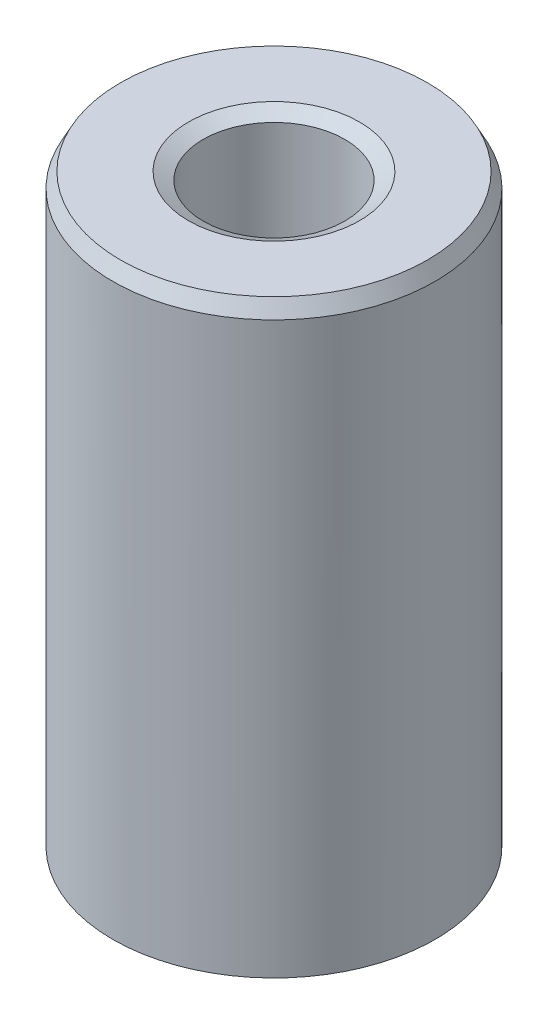
ISO-10303-21;
HEADER;
FILE_DESCRIPTION(('STEP AP214'),'2;1');
FILE_NAME('part.step','',(''),(''),'','','');
FILE_SCHEMA(('AUTOMOTIVE_DESIGN { 1 0 10303 214 1 1 1 1 }'));
ENDSEC;
DATA;
#1=APPLICATION_CONTEXT('core data for automotive mechanical design processes');
#2=APPLICATION_PROTOCOL_DEFINITION('international standard','automotive_design',2000,#1);
#3=PRODUCT_CONTEXT('',#1,'mechanical');
#4=PRODUCT('Part','Part','',(#3));
#5=PRODUCT_RELATED_PRODUCT_CATEGORY('part','',(#4));
#6=PRODUCT_DEFINITION_FORMATION('','',#4);
#7=PRODUCT_DEFINITION_CONTEXT('part definition',#1,'design');
#8=PRODUCT_DEFINITION('design','',#6,#7);
#9=PRODUCT_DEFINITION_SHAPE('','',#8);
#10=(LENGTH_UNIT() NAMED_UNIT(*) SI_UNIT(.MILLI.,.METRE.));
#11=(NAMED_UNIT(*) PLANE_ANGLE_UNIT() SI_UNIT($,.RADIAN.));
#12=(NAMED_UNIT(*) SI_UNIT($,.STERADIAN.) SOLID_ANGLE_UNIT());
#13=UNCERTAINTY_MEASURE_WITH_UNIT(LENGTH_MEASURE(1.E-05),#10,'distance_accuracy_value','');
#14=(GEOMETRIC_REPRESENTATION_CONTEXT(3) GLOBAL_UNCERTAINTY_ASSIGNED_CONTEXT((#13)) GLOBAL_UNIT_ASSIGNED_CONTEXT((#10,
#11,#12)) REPRESENTATION_CONTEXT('',''));
#15=CARTESIAN_POINT('',(0.,0.,0.));
#16=DIRECTION('',(0.,0.,1.));
#17=DIRECTION('',(1.,0.,0.));
#18=AXIS2_PLACEMENT_3D('',#15,#16,#17);
#19=CARTESIAN_POINT('',(0.,55.1128851822526,0.));
#20=DIRECTION('',(0.,-1.,0.));
#21=DIRECTION('',(0.,0.,-1.));
#22=AXIS2_PLACEMENT_3D('',#19,#20,#21);
#23=CYLINDRICAL_SURFACE('',#22,15.);
#24=CARTESIAN_POINT('',(0.,0.715288435799932,0.));
#25=DIRECTION('',(0.,1.,0.));
#26=DIRECTION('',(0.,0.,1.));
#27=AXIS2_PLACEMENT_3D('',#24,#25,#26);
#28=CIRCLE('',#27,15.);
#29=CARTESIAN_POINT('',(0.,0.715288435799925,-15.));
#30=VERTEX_POINT('',#29);
#31=EDGE_CURVE('E10',#30,#30,#28,.T.);
#32=CARTESIAN_POINT('',(0.,53.7436358366034,0.));
#33=DIRECTION('',(0.,1.,0.));
#34=DIRECTION('',(0.,0.,1.));
#35=AXIS2_PLACEMENT_3D('',#32,#33,#34);
#36=CIRCLE('',#35,15.);
#37=CARTESIAN_POINT('',(0.,53.7436358366034,-15.));
#38=VERTEX_POINT('',#37);
#39=EDGE_CURVE('E50',#38,#38,#36,.F.);
#40=CARTESIAN_POINT('',(0.,0.715288435799925,-15.));
#41=CARTESIAN_POINT('',(0.,1.2676670545583,-15.));
#42=CARTESIAN_POINT('',(0.,1.82004567331667,-15.));
#43=CARTESIAN_POINT('',(0.,2.92480291083341,-15.));
#44=CARTESIAN_POINT('',(0.,3.47718152959178,-15.));
#45=CARTESIAN_POINT('',(0.,4.58193876710852,-15.));
#46=CARTESIAN_POINT('',(0.,5.13431738586689,-15.));
#47=CARTESIAN_POINT('',(0.,6.23907462338362,-15.));
#48=CARTESIAN_POINT('',(0.,6.79145324214199,-15.));
#49=CARTESIAN_POINT('',(0.,7.89621047965873,-15.));
#50=CARTESIAN_POINT('',(0.,8.4485890984171,-15.));
#51=CARTESIAN_POINT('',(0.,9.55334633593384,-15.));
#52=CARTESIAN_POINT('',(0.,10.1057249546922,-15.));
#53=CARTESIAN_POINT('',(0.,11.210482192209,-15.));
#54=CARTESIAN_POINT('',(0.,11.7628608109673,-15.));
#55=CARTESIAN_POINT('',(0.,12.8676180484841,-15.));
#56=CARTESIAN_POINT('',(0.,13.4199966672424,-15.));
#57=CARTESIAN_POINT('',(0.,14.5247539047592,-15.));
#58=CARTESIAN_POINT('',(0.,15.0771325235175,-15.));
#59=CARTESIAN_POINT('',(0.,16.1818897610343,-15.));
#60=CARTESIAN_POINT('',(0.,16.7342683797926,-15.));
#61=CARTESIAN_POINT('',(0.,17.8390256173094,-15.));
#62=CARTESIAN_POINT('',(0.,18.3914042360678,-15.));
#63=CARTESIAN_POINT('',(0.,19.4961614735845,-15.));
#64=CARTESIAN_POINT('',(0.,20.0485400923429,-15.));
#65=CARTESIAN_POINT('',(0.,21.1532973298596,-15.));
#66=CARTESIAN_POINT('',(0.,21.705675948618,-15.));
#67=CARTESIAN_POINT('',(0.,22.8104331861347,-15.));
#68=CARTESIAN_POINT('',(0.,23.3628118048931,-15.));
#69=CARTESIAN_POINT('',(0.,24.4675690424098,-15.));
#70=CARTESIAN_POINT('',(0.,25.0199476611682,-15.));
#71=CARTESIAN_POINT('',(0.,26.1247048986849,-15.));
#72=CARTESIAN_POINT('',(0.,26.6770835174433,-15.));
#73=CARTESIAN_POINT('',(0.,27.78184075496,-15.));
#74=CARTESIAN_POINT('',(0.,28.3342193737184,-15.));
#75=CARTESIAN_POINT('',(0.,29.4389766112352,-15.));
#76=CARTESIAN_POINT('',(0.,29.9913552299935,-15.));
#77=CARTESIAN_POINT('',(0.,31.0961124675103,-15.));
#78=CARTESIAN_POINT('',(0.,31.6484910862686,-15.));
#79=CARTESIAN_POINT('',(0.,32.7532483237854,-15.));
#80=CARTESIAN_POINT('',(0.,33.3056269425437,-15.));
#81=CARTESIAN_POINT('',(0.,34.4103841800605,-15.));
#82=CARTESIAN_POINT('',(0.,34.9627627988189,-15.));
#83=CARTESIAN_POINT('',(0.,36.0675200363356,-15.));
#84=CARTESIAN_POINT('',(0.,36.619898655094,-15.));
#85=CARTESIAN_POINT('',(0.,37.7246558926107,-15.));
#86=CARTESIAN_POINT('',(0.,38.2770345113691,-15.));
#87=CARTESIAN_POINT('',(0.,39.3817917488858,-15.));
#88=CARTESIAN_POINT('',(0.,39.9341703676442,-15.));
#89=CARTESIAN_POINT('',(0.,41.0389276051609,-15.));
#90=CARTESIAN_POINT('',(0.,41.5913062239193,-15.));
#91=CARTESIAN_POINT('',(0.,42.696063461436,-15.));
#92=CARTESIAN_POINT('',(0.,43.2484420801944,-15.));
#93=CARTESIAN_POINT('',(0.,44.3531993177111,-15.));
#94=CARTESIAN_POINT('',(0.,44.9055779364695,-15.));
#95=CARTESIAN_POINT('',(0.,46.0103351739862,-15.));
#96=CARTESIAN_POINT('',(0.,46.5627137927446,-15.));
#97=CARTESIAN_POINT('',(0.,47.6674710302614,-15.));
#98=CARTESIAN_POINT('',(0.,48.2198496490197,-15.));
#99=CARTESIAN_POINT('',(0.,49.3246068865365,-15.));
#100=CARTESIAN_POINT('',(0.,49.8769855052948,-15.));
#101=CARTESIAN_POINT('',(0.,50.9817427428116,-15.));
#102=CARTESIAN_POINT('',(0.,51.5341213615699,-15.));
#103=CARTESIAN_POINT('',(0.,52.6388785990867,-15.));
#104=CARTESIAN_POINT('',(0.,53.191257217845,-15.));
#105=CARTESIAN_POINT('',(0.,53.7436358366034,-15.));
#106=B_SPLINE_CURVE_WITH_KNOTS('',3,(#40,#41,#42,#43,#44,#45,#46,#47,#48,#49,#50,#51,#52,#53,
#54,#55,#56,#57,#58,#59,#60,#61,#62,#63,#64,#65,#66,#67,#68,#69,#70,#71,#72,#73,#74,#75,#76,#77,
#78,#79,#80,#81,#82,#83,#84,#85,#86,#87,#88,#89,#90,#91,#92,#93,#94,#95,#96,#97,#98,#99,#100,
#101,#102,#103,#104,#105),.UNSPECIFIED.,.F.,.F.,(4,2,2,2,2,2,2,2,2,2,2,2,2,2,2,2,2,2,2,2,2,2,2,
2,2,2,2,2,2,2,2,2,4),(0.,1.65713585627511,3.31427171255022,4.97140756882533,6.62854342510043,
8.28567928137555,9.94281513765065,11.5999509939258,13.2570868502009,14.914222706476,
16.5713585627511,18.2284944190262,19.8856302753013,21.5427661315764,23.1999019878515,
24.8570378441266,26.5141737004017,28.1713095566769,29.828445412952,31.4855812692271,
33.1427171255022,34.7998529817773,36.4569888380524,38.1141246943275,39.7712605506026,
41.4283964068777,43.0855322631528,44.7426681194279,46.3998039757031,48.0569398319782,
49.7140756882533,51.3712115445284,53.0283474008035),.UNSPECIFIED.);
#107=EDGE_CURVE('BSEAM39',#30,#38,#106,.T.);
#108=ORIENTED_EDGE('',*,*,#31,.T.);
#109=ORIENTED_EDGE('',*,*,#39,.T.);
#110=ORIENTED_EDGE('',*,*,#107,.T.);
#111=ORIENTED_EDGE('',*,*,#107,.F.);
#112=EDGE_LOOP('',(#108,#110,#109,#111));
#113=FACE_BOUND('',#112,.T.);
#114=ADVANCED_FACE('F39',(#113),#23,.T.);
#115=CARTESIAN_POINT('',(0.,55.1128851822526,0.));
#116=DIRECTION('',(0.,1.,0.));
#117=DIRECTION('',(0.,0.,1.));
#118=AXIS2_PLACEMENT_3D('',#115,#116,#117);
#119=PLANE('',#118);
#120=CARTESIAN_POINT('',(0.,55.1128851822526,0.));
#121=DIRECTION('',(0.,1.,0.));
#122=DIRECTION('',(0.,0.,1.));
#123=AXIS2_PLACEMENT_3D('',#120,#121,#122);
#124=CIRCLE('',#123,7.95987748376961);
#125=CARTESIAN_POINT('',(0.,55.1128851822526,7.95987748376961));
#126=VERTEX_POINT('',#125);
#127=EDGE_CURVE('E58',#126,#126,#124,.F.);
#128=ORIENTED_EDGE('',*,*,#127,.T.);
#129=EDGE_LOOP('',(#128));
#130=FACE_BOUND('',#129,.T.);
#131=CARTESIAN_POINT('',(0.,55.1128851822526,0.));
#132=DIRECTION('',(0.,1.,0.));
#133=DIRECTION('',(0.,0.,1.));
#134=AXIS2_PLACEMENT_3D('',#131,#132,#133);
#135=CIRCLE('',#134,14.2847115642001);
#136=CARTESIAN_POINT('',(0.,55.1128851822526,14.2847115642001));
#137=VERTEX_POINT('',#136);
#138=EDGE_CURVE('E61',#137,#137,#135,.T.);
#139=ORIENTED_EDGE('',*,*,#138,.T.);
#140=EDGE_LOOP('',(#139));
#141=FACE_BOUND('',#140,.T.);
#142=ADVANCED_FACE('F88',(#130,#141),#119,.T.);
#143=CARTESIAN_POINT('',(0.,0.,0.));
#144=DIRECTION('',(0.,1.,0.));
#145=DIRECTION('',(0.,0.,1.));
#146=AXIS2_PLACEMENT_3D('',#143,#144,#145);
#147=PLANE('',#146);
#148=CARTESIAN_POINT('',(0.,0.,0.));
#149=DIRECTION('',(0.,1.,0.));
#150=DIRECTION('',(0.,0.,1.));
#151=AXIS2_PLACEMENT_3D('',#148,#149,#150);
#152=CIRCLE('',#151,7.30591657392028);
#153=CARTESIAN_POINT('',(0.,0.,7.30591657392028));
#154=VERTEX_POINT('',#153);
#155=EDGE_CURVE('E51',#154,#154,#152,.T.);
#156=ORIENTED_EDGE('',*,*,#155,.T.);
#157=EDGE_LOOP('',(#156));
#158=FACE_BOUND('',#157,.T.);
#159=CARTESIAN_POINT('',(0.,0.,0.));
#160=DIRECTION('',(0.,1.,0.));
#161=DIRECTION('',(0.,0.,1.));
#162=AXIS2_PLACEMENT_3D('',#159,#160,#161);
#163=CIRCLE('',#162,13.6307506543508);
#164=CARTESIAN_POINT('',(0.,0.,13.6307506543508));
#165=VERTEX_POINT('',#164);
#166=EDGE_CURVE('E54',#165,#165,#163,.F.);
#167=ORIENTED_EDGE('',*,*,#166,.T.);
#168=EDGE_LOOP('',(#167));
#169=FACE_BOUND('',#168,.T.);
#170=ADVANCED_FACE('F83',(#158,#169),#147,.F.);
#171=CARTESIAN_POINT('',(0.,55.1128851822526,0.));
#172=DIRECTION('',(0.,-1.,0.));
#173=DIRECTION('',(0.,0.,-1.));
#174=AXIS2_PLACEMENT_3D('',#171,#172,#173);
#175=CYLINDRICAL_SURFACE('',#174,6.59062813812038);
#176=CARTESIAN_POINT('',(0.,54.3975967464526,0.));
#177=DIRECTION('',(0.,1.,0.));
#178=DIRECTION('',(0.,0.,1.));
#179=AXIS2_PLACEMENT_3D('',#176,#177,#178);
#180=CIRCLE('',#179,6.59062813812038);
#181=CARTESIAN_POINT('',(0.,54.3975967464526,-6.59062813812038));
#182=VERTEX_POINT('',#181);
#183=EDGE_CURVE('E67',#182,#182,#180,.T.);
#184=CARTESIAN_POINT('',(0.,1.36924934564917,0.));
#185=DIRECTION('',(0.,1.,0.));
#186=DIRECTION('',(0.,0.,1.));
#187=AXIS2_PLACEMENT_3D('',#184,#185,#186);
#188=CIRCLE('',#187,6.59062813812038);
#189=CARTESIAN_POINT('',(0.,1.36924934564917,-6.59062813812038));
#190=VERTEX_POINT('',#189);
#191=EDGE_CURVE('E69',#190,#190,#188,.F.);
#192=CARTESIAN_POINT('',(0.,54.3975967464526,-6.59062813812038));
#193=CARTESIAN_POINT('',(0.,53.8452181276943,-6.59062813812038));
#194=CARTESIAN_POINT('',(0.,53.2928395089359,-6.59062813812038));
#195=CARTESIAN_POINT('',(0.,52.1880822714191,-6.59062813812038));
#196=CARTESIAN_POINT('',(0.,51.6357036526608,-6.59062813812038));
#197=CARTESIAN_POINT('',(0.,50.530946415144,-6.59062813812038));
#198=CARTESIAN_POINT('',(0.,49.9785677963857,-6.59062813812038));
#199=CARTESIAN_POINT('',(0.,48.8738105588689,-6.59062813812038));
#200=CARTESIAN_POINT('',(0.,48.3214319401106,-6.59062813812038));
#201=CARTESIAN_POINT('',(0.,47.2166747025938,-6.59062813812038));
#202=CARTESIAN_POINT('',(0.,46.6642960838355,-6.59062813812038));
#203=CARTESIAN_POINT('',(0.,45.5595388463187,-6.59062813812038));
#204=CARTESIAN_POINT('',(0.,45.0071602275603,-6.59062813812038));
#205=CARTESIAN_POINT('',(0.,43.9024029900436,-6.59062813812038));
#206=CARTESIAN_POINT('',(0.,43.3500243712852,-6.59062813812038));
#207=CARTESIAN_POINT('',(0.,42.2452671337685,-6.59062813812038));
#208=CARTESIAN_POINT('',(0.,41.6928885150101,-6.59062813812038));
#209=CARTESIAN_POINT('',(0.,40.5881312774934,-6.59062813812038));
#210=CARTESIAN_POINT('',(0.,40.035752658735,-6.59062813812038));
#211=CARTESIAN_POINT('',(0.,38.9309954212183,-6.59062813812038));
#212=CARTESIAN_POINT('',(0.,38.3786168024599,-6.59062813812038));
#213=CARTESIAN_POINT('',(0.,37.2738595649432,-6.59062813812038));
#214=CARTESIAN_POINT('',(0.,36.7214809461848,-6.59062813812038));
#215=CARTESIAN_POINT('',(0.,35.6167237086681,-6.59062813812038));
#216=CARTESIAN_POINT('',(0.,35.0643450899097,-6.59062813812038));
#217=CARTESIAN_POINT('',(0.,33.959587852393,-6.59062813812038));
#218=CARTESIAN_POINT('',(0.,33.4072092336346,-6.59062813812038));
#219=CARTESIAN_POINT('',(0.,32.3024519961179,-6.59062813812038));
#220=CARTESIAN_POINT('',(0.,31.7500733773595,-6.59062813812038));
#221=CARTESIAN_POINT('',(0.,30.6453161398427,-6.59062813812038));
#222=CARTESIAN_POINT('',(0.,30.0929375210844,-6.59062813812038));
#223=CARTESIAN_POINT('',(0.,28.9881802835676,-6.59062813812038));
#224=CARTESIAN_POINT('',(0.,28.4358016648093,-6.59062813812038));
#225=CARTESIAN_POINT('',(0.,27.3310444272925,-6.59062813812038));
#226=CARTESIAN_POINT('',(0.,26.7786658085342,-6.59062813812038));
#227=CARTESIAN_POINT('',(0.,25.6739085710174,-6.59062813812038));
#228=CARTESIAN_POINT('',(0.,25.1215299522591,-6.59062813812038));
#229=CARTESIAN_POINT('',(0.,24.0167727147423,-6.59062813812038));
#230=CARTESIAN_POINT('',(0.,23.4643940959839,-6.59062813812038));
#231=CARTESIAN_POINT('',(0.,22.3596368584672,-6.59062813812038));
#232=CARTESIAN_POINT('',(0.,21.8072582397088,-6.59062813812038));
#233=CARTESIAN_POINT('',(0.,20.7025010021921,-6.59062813812038));
#234=CARTESIAN_POINT('',(0.,20.1501223834337,-6.59062813812038));
#235=CARTESIAN_POINT('',(0.,19.045365145917,-6.59062813812038));
#236=CARTESIAN_POINT('',(0.,18.4929865271586,-6.59062813812038));
#237=CARTESIAN_POINT('',(0.,17.3882292896419,-6.59062813812038));
#238=CARTESIAN_POINT('',(0.,16.8358506708835,-6.59062813812038));
#239=CARTESIAN_POINT('',(0.,15.7310934333668,-6.59062813812038));
#240=CARTESIAN_POINT('',(0.,15.1787148146084,-6.59062813812038));
#241=CARTESIAN_POINT('',(0.,14.0739575770917,-6.59062813812038));
#242=CARTESIAN_POINT('',(0.,13.5215789583333,-6.59062813812038));
#243=CARTESIAN_POINT('',(0.,12.4168217208166,-6.59062813812038));
#244=CARTESIAN_POINT('',(0.,11.8644431020582,-6.59062813812038));
#245=CARTESIAN_POINT('',(0.,10.7596858645415,-6.59062813812038));
#246=CARTESIAN_POINT('',(0.,10.2073072457831,-6.59062813812038));
#247=CARTESIAN_POINT('',(0.,9.10255000826634,-6.59062813812038));
#248=CARTESIAN_POINT('',(0.,8.55017138950797,-6.59062813812038));
#249=CARTESIAN_POINT('',(0.,7.44541415199124,-6.59062813812038));
#250=CARTESIAN_POINT('',(0.,6.89303553323287,-6.59062813812038));
#251=CARTESIAN_POINT('',(0.,5.78827829571613,-6.59062813812038));
#252=CARTESIAN_POINT('',(0.,5.23589967695776,-6.59062813812038));
#253=CARTESIAN_POINT('',(0.,4.13114243944102,-6.59062813812038));
#254=CARTESIAN_POINT('',(0.,3.57876382068265,-6.59062813812038));
#255=CARTESIAN_POINT('',(0.,2.47400658316591,-6.59062813812038));
#256=CARTESIAN_POINT('',(0.,1.92162796440754,-6.59062813812038));
#257=CARTESIAN_POINT('',(0.,1.36924934564917,-6.59062813812038));
#258=B_SPLINE_CURVE_WITH_KNOTS('',3,(#192,#193,#194,#195,#196,#197,#198,#199,#200,#201,#202,
#203,#204,#205,#206,#207,#208,#209,#210,#211,#212,#213,#214,#215,#216,#217,#218,#219,#220,#221,
#222,#223,#224,#225,#226,#227,#228,#229,#230,#231,#232,#233,#234,#235,#236,#237,#238,#239,#240,
#241,#242,#243,#244,#245,#246,#247,#248,#249,#250,#251,#252,#253,#254,#255,#256,#257),
.UNSPECIFIED.,.F.,.F.,(4,2,2,2,2,2,2,2,2,2,2,2,2,2,2,2,2,2,2,2,2,2,2,2,2,2,2,2,2,2,2,2,4),(0.,
1.6571358562751,3.31427171255021,4.97140756882532,6.62854342510043,8.28567928137553,
9.94281513765064,11.5999509939258,13.2570868502009,14.914222706476,16.5713585627511,
18.2284944190262,19.8856302753013,21.5427661315764,23.1999019878515,24.8570378441266,
26.5141737004017,28.1713095566768,29.8284454129519,31.485581269227,33.1427171255022,
34.7998529817773,36.4569888380524,38.1141246943275,39.7712605506026,41.4283964068777,
43.0855322631528,44.7426681194279,46.399803975703,48.0569398319781,49.7140756882532,
51.3712115445283,53.0283474008034),.UNSPECIFIED.);
#259=EDGE_CURVE('BSEAM71',#182,#190,#258,.T.);
#260=ORIENTED_EDGE('',*,*,#183,.T.);
#261=ORIENTED_EDGE('',*,*,#191,.T.);
#262=ORIENTED_EDGE('',*,*,#259,.T.);
#263=ORIENTED_EDGE('',*,*,#259,.F.);
#264=EDGE_LOOP('',(#260,#262,#261,#263));
#265=FACE_BOUND('',#264,.T.);
#266=ADVANCED_FACE('F71',(#265),#175,.F.);
#267=CARTESIAN_POINT('',(0.,54.3975967464526,0.));
#268=DIRECTION('',(0.,1.,0.));
#269=DIRECTION('',(0.,0.,1.));
#270=AXIS2_PLACEMENT_3D('',#267,#268,#269);
#271=CONICAL_SURFACE('',#270,6.59062813812038,1.08939398090596);
#272=ORIENTED_EDGE('',*,*,#127,.F.);
#273=EDGE_LOOP('',(#272));
#274=FACE_BOUND('',#273,.T.);
#275=ORIENTED_EDGE('',*,*,#183,.F.);
#276=EDGE_LOOP('',(#275));
#277=FACE_BOUND('',#276,.T.);
#278=ADVANCED_FACE('F77',(#274,#277),#271,.F.);
#279=CARTESIAN_POINT('',(0.,0.,0.));
#280=DIRECTION('',(0.,-1.,0.));
#281=DIRECTION('',(0.,0.,-1.));
#282=AXIS2_PLACEMENT_3D('',#279,#280,#281);
#283=CONICAL_SURFACE('',#282,7.30591657392028,0.481402345888939);
#284=ORIENTED_EDGE('',*,*,#191,.F.);
#285=EDGE_LOOP('',(#284));
#286=FACE_BOUND('',#285,.T.);
#287=ORIENTED_EDGE('',*,*,#155,.F.);
#288=EDGE_LOOP('',(#287));
#289=FACE_BOUND('',#288,.T.);
#290=ADVANCED_FACE('F73',(#286,#289),#283,.F.);
#291=CARTESIAN_POINT('',(0.,0.715288435799932,0.));
#292=DIRECTION('',(0.,1.,0.));
#293=DIRECTION('',(0.,0.,1.));
#294=AXIS2_PLACEMENT_3D('',#291,#292,#293);
#295=CONICAL_SURFACE('',#294,15.,1.08939398090595);
#296=ORIENTED_EDGE('',*,*,#166,.F.);
#297=EDGE_LOOP('',(#296));
#298=FACE_BOUND('',#297,.T.);
#299=ORIENTED_EDGE('',*,*,#31,.F.);
#300=EDGE_LOOP('',(#299));
#301=FACE_BOUND('',#300,.T.);
#302=ADVANCED_FACE('F76',(#298,#301),#295,.T.);
#303=CARTESIAN_POINT('',(0.,55.1128851822526,0.));
#304=DIRECTION('',(0.,-1.,0.));
#305=DIRECTION('',(0.,0.,-1.));
#306=AXIS2_PLACEMENT_3D('',#303,#304,#305);
#307=CONICAL_SURFACE('',#306,14.2847115642001,0.481402345888938);
#308=ORIENTED_EDGE('',*,*,#39,.F.);
#309=EDGE_LOOP('',(#308));
#310=FACE_BOUND('',#309,.T.);
#311=ORIENTED_EDGE('',*,*,#138,.F.);
#312=EDGE_LOOP('',(#311));
#313=FACE_BOUND('',#312,.T.);
#314=ADVANCED_FACE('F45',(#310,#313),#307,.T.);
#315=CLOSED_SHELL('',(#114,#142,#170,#266,#278,#290,#302,#314));
#316=MANIFOLD_SOLID_BREP('B2',#315);
#317=ADVANCED_BREP_SHAPE_REPRESENTATION('',(#18,#316),#14);
#318=SHAPE_DEFINITION_REPRESENTATION(#9,#317);
ENDSEC;
END-ISO-10303-21;
